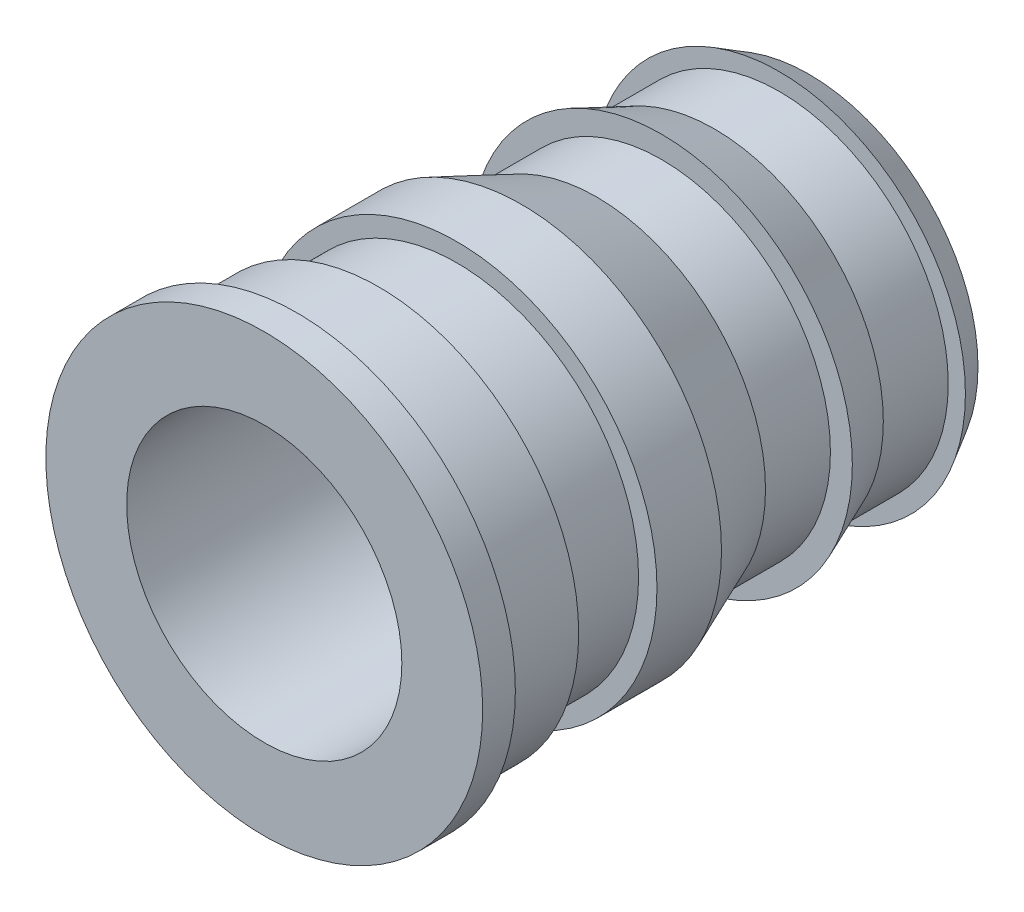
ISO-10303-21;
HEADER;
FILE_DESCRIPTION(('STEP AP214'),'2;1');
FILE_NAME('part.step','',(''),(''),'','','');
FILE_SCHEMA(('AUTOMOTIVE_DESIGN { 1 0 10303 214 1 1 1 1 }'));
ENDSEC;
DATA;
#1=APPLICATION_CONTEXT('core data for automotive mechanical design processes');
#2=APPLICATION_PROTOCOL_DEFINITION('international standard','automotive_design',2000,#1);
#3=PRODUCT_CONTEXT('',#1,'mechanical');
#4=PRODUCT('Part','Part','',(#3));
#5=PRODUCT_RELATED_PRODUCT_CATEGORY('part','',(#4));
#6=PRODUCT_DEFINITION_FORMATION('','',#4);
#7=PRODUCT_DEFINITION_CONTEXT('part definition',#1,'design');
#8=PRODUCT_DEFINITION('design','',#6,#7);
#9=PRODUCT_DEFINITION_SHAPE('','',#8);
#10=(LENGTH_UNIT() NAMED_UNIT(*) SI_UNIT(.MILLI.,.METRE.));
#11=(NAMED_UNIT(*) PLANE_ANGLE_UNIT() SI_UNIT($,.RADIAN.));
#12=(NAMED_UNIT(*) SI_UNIT($,.STERADIAN.) SOLID_ANGLE_UNIT());
#13=UNCERTAINTY_MEASURE_WITH_UNIT(LENGTH_MEASURE(1.E-05),#10,'distance_accuracy_value','');
#14=(GEOMETRIC_REPRESENTATION_CONTEXT(3) GLOBAL_UNCERTAINTY_ASSIGNED_CONTEXT((#13)) GLOBAL_UNIT_ASSIGNED_CONTEXT((#10,
#11,#12)) REPRESENTATION_CONTEXT('',''));
#15=CARTESIAN_POINT('',(0.,0.,0.));
#16=DIRECTION('',(0.,0.,1.));
#17=DIRECTION('',(1.,0.,0.));
#18=AXIS2_PLACEMENT_3D('',#15,#16,#17);
#19=CARTESIAN_POINT('',(0.,0.,3.96));
#20=DIRECTION('',(0.,0.,1.));
#21=DIRECTION('',(1.,0.,0.));
#22=AXIS2_PLACEMENT_3D('',#19,#20,#21);
#23=CYLINDRICAL_SURFACE('',#22,2.);
#24=CARTESIAN_POINT('',(0.,0.,-3.96));
#25=DIRECTION('',(0.,0.,1.));
#26=DIRECTION('',(1.,0.,0.));
#27=AXIS2_PLACEMENT_3D('',#24,#25,#26);
#28=CIRCLE('',#27,2.);
#29=CARTESIAN_POINT('',(2.,0.,-3.96));
#30=VERTEX_POINT('',#29);
#31=EDGE_CURVE('E92',#30,#30,#28,.T.);
#32=ORIENTED_EDGE('',*,*,#31,.F.);
#33=EDGE_LOOP('',(#32));
#34=FACE_BOUND('',#33,.T.);
#35=CARTESIAN_POINT('',(0.,0.,3.96));
#36=DIRECTION('',(0.,0.,1.));
#37=DIRECTION('',(1.,0.,0.));
#38=AXIS2_PLACEMENT_3D('',#35,#36,#37);
#39=CIRCLE('',#38,2.);
#40=CARTESIAN_POINT('',(2.,0.,3.96));
#41=VERTEX_POINT('',#40);
#42=EDGE_CURVE('E10',#41,#41,#39,.T.);
#43=ORIENTED_EDGE('',*,*,#42,.T.);
#44=EDGE_LOOP('',(#43));
#45=FACE_BOUND('',#44,.T.);
#46=ADVANCED_FACE('F37',(#34,#45),#23,.F.);
#47=CARTESIAN_POINT('',(0.,2.,3.96));
#48=DIRECTION('',(0.,0.,-1.));
#49=DIRECTION('',(-1.,0.,0.));
#50=AXIS2_PLACEMENT_3D('',#47,#48,#49);
#51=PLANE('',#50);
#52=ORIENTED_EDGE('',*,*,#42,.F.);
#53=EDGE_LOOP('',(#52));
#54=FACE_BOUND('',#53,.T.);
#55=CARTESIAN_POINT('',(0.,0.,3.96));
#56=DIRECTION('',(0.,0.,1.));
#57=DIRECTION('',(1.,0.,0.));
#58=AXIS2_PLACEMENT_3D('',#55,#56,#57);
#59=CIRCLE('',#58,3.175);
#60=CARTESIAN_POINT('',(3.175,0.,3.96));
#61=VERTEX_POINT('',#60);
#62=EDGE_CURVE('E43',#61,#61,#59,.T.);
#63=ORIENTED_EDGE('',*,*,#62,.T.);
#64=EDGE_LOOP('',(#63));
#65=FACE_BOUND('',#64,.T.);
#66=ADVANCED_FACE('F99',(#54,#65),#51,.F.);
#67=CARTESIAN_POINT('',(0.,0.,3.96));
#68=DIRECTION('',(0.,0.,1.));
#69=DIRECTION('',(1.,0.,0.));
#70=AXIS2_PLACEMENT_3D('',#67,#68,#69);
#71=CYLINDRICAL_SURFACE('',#70,3.175);
#72=ORIENTED_EDGE('',*,*,#62,.F.);
#73=EDGE_LOOP('',(#72));
#74=FACE_BOUND('',#73,.T.);
#75=CARTESIAN_POINT('',(0.,0.,3.4848));
#76=DIRECTION('',(0.,0.,1.));
#77=DIRECTION('',(1.,0.,0.));
#78=AXIS2_PLACEMENT_3D('',#75,#76,#77);
#79=CIRCLE('',#78,3.175);
#80=CARTESIAN_POINT('',(3.175,0.,3.4848));
#81=VERTEX_POINT('',#80);
#82=EDGE_CURVE('E47',#81,#81,#79,.T.);
#83=ORIENTED_EDGE('',*,*,#82,.T.);
#84=EDGE_LOOP('',(#83));
#85=FACE_BOUND('',#84,.T.);
#86=ADVANCED_FACE('F103',(#74,#85),#71,.T.);
#87=CARTESIAN_POINT('',(0.,3.175,3.4848));
#88=DIRECTION('',(0.,0.,1.));
#89=DIRECTION('',(1.,0.,0.));
#90=AXIS2_PLACEMENT_3D('',#87,#88,#89);
#91=PLANE('',#90);
#92=ORIENTED_EDGE('',*,*,#82,.F.);
#93=EDGE_LOOP('',(#92));
#94=FACE_BOUND('',#93,.T.);
#95=CARTESIAN_POINT('',(0.,0.,3.4848));
#96=DIRECTION('',(0.,0.,1.));
#97=DIRECTION('',(1.,0.,0.));
#98=AXIS2_PLACEMENT_3D('',#95,#96,#97);
#99=CIRCLE('',#98,2.9075);
#100=CARTESIAN_POINT('',(2.9075,0.,3.4848));
#101=VERTEX_POINT('',#100);
#102=EDGE_CURVE('E51',#101,#101,#99,.T.);
#103=ORIENTED_EDGE('',*,*,#102,.T.);
#104=EDGE_LOOP('',(#103));
#105=FACE_BOUND('',#104,.T.);
#106=ADVANCED_FACE('F108',(#94,#105),#91,.F.);
#107=CARTESIAN_POINT('',(0.,0.,3.96));
#108=DIRECTION('',(0.,0.,1.));
#109=DIRECTION('',(1.,0.,0.));
#110=AXIS2_PLACEMENT_3D('',#107,#108,#109);
#111=CYLINDRICAL_SURFACE('',#110,2.9075);
#112=ORIENTED_EDGE('',*,*,#102,.F.);
#113=EDGE_LOOP('',(#112));
#114=FACE_BOUND('',#113,.T.);
#115=CARTESIAN_POINT('',(0.,0.,2.2968));
#116=DIRECTION('',(0.,0.,1.));
#117=DIRECTION('',(1.,0.,0.));
#118=AXIS2_PLACEMENT_3D('',#115,#116,#117);
#119=CIRCLE('',#118,2.9075);
#120=CARTESIAN_POINT('',(2.9075,0.,2.2968));
#121=VERTEX_POINT('',#120);
#122=EDGE_CURVE('E56',#121,#121,#119,.T.);
#123=ORIENTED_EDGE('',*,*,#122,.T.);
#124=EDGE_LOOP('',(#123));
#125=FACE_BOUND('',#124,.T.);
#126=ADVANCED_FACE('F114',(#114,#125),#111,.T.);
#127=CARTESIAN_POINT('',(0.,2.9075,2.2968));
#128=DIRECTION('',(0.,0.,1.));
#129=DIRECTION('',(1.,0.,0.));
#130=AXIS2_PLACEMENT_3D('',#127,#128,#129);
#131=PLANE('',#130);
#132=ORIENTED_EDGE('',*,*,#122,.F.);
#133=EDGE_LOOP('',(#132));
#134=FACE_BOUND('',#133,.T.);
#135=CARTESIAN_POINT('',(0.,0.,2.2968));
#136=DIRECTION('',(0.,0.,1.));
#137=DIRECTION('',(1.,0.,0.));
#138=AXIS2_PLACEMENT_3D('',#135,#136,#137);
#139=CIRCLE('',#138,2.64);
#140=CARTESIAN_POINT('',(2.64,0.,2.2968));
#141=VERTEX_POINT('',#140);
#142=EDGE_CURVE('E59',#141,#141,#139,.T.);
#143=ORIENTED_EDGE('',*,*,#142,.T.);
#144=EDGE_LOOP('',(#143));
#145=FACE_BOUND('',#144,.T.);
#146=ADVANCED_FACE('F118',(#134,#145),#131,.F.);
#147=CARTESIAN_POINT('',(0.,0.,3.96));
#148=DIRECTION('',(0.,0.,1.));
#149=DIRECTION('',(1.,0.,0.));
#150=AXIS2_PLACEMENT_3D('',#147,#148,#149);
#151=CYLINDRICAL_SURFACE('',#150,2.64);
#152=ORIENTED_EDGE('',*,*,#142,.F.);
#153=EDGE_LOOP('',(#152));
#154=FACE_BOUND('',#153,.T.);
#155=CARTESIAN_POINT('',(0.,0.,1.15894666632655));
#156=DIRECTION('',(0.,0.,1.));
#157=DIRECTION('',(1.,0.,0.));
#158=AXIS2_PLACEMENT_3D('',#155,#156,#157);
#159=CIRCLE('',#158,2.64);
#160=CARTESIAN_POINT('',(2.64,0.,1.15894666632655));
#161=VERTEX_POINT('',#160);
#162=EDGE_CURVE('E62',#161,#161,#159,.T.);
#163=ORIENTED_EDGE('',*,*,#162,.T.);
#164=EDGE_LOOP('',(#163));
#165=FACE_BOUND('',#164,.T.);
#166=ADVANCED_FACE('F122',(#154,#165),#151,.T.);
#167=CARTESIAN_POINT('',(0.,2.64,1.15894666632655));
#168=DIRECTION('',(0.,0.,-1.));
#169=DIRECTION('',(-1.,0.,0.));
#170=AXIS2_PLACEMENT_3D('',#167,#168,#169);
#171=PLANE('',#170);
#172=ORIENTED_EDGE('',*,*,#162,.F.);
#173=EDGE_LOOP('',(#172));
#174=FACE_BOUND('',#173,.T.);
#175=CARTESIAN_POINT('',(0.,0.,1.15894666632655));
#176=DIRECTION('',(0.,0.,1.));
#177=DIRECTION('',(1.,0.,0.));
#178=AXIS2_PLACEMENT_3D('',#175,#176,#177);
#179=CIRCLE('',#178,2.9075);
#180=CARTESIAN_POINT('',(2.9075,0.,1.15894666632655));
#181=VERTEX_POINT('',#180);
#182=EDGE_CURVE('E65',#181,#181,#179,.T.);
#183=ORIENTED_EDGE('',*,*,#182,.T.);
#184=EDGE_LOOP('',(#183));
#185=FACE_BOUND('',#184,.T.);
#186=ADVANCED_FACE('F126',(#174,#185),#171,.F.);
#187=CARTESIAN_POINT('',(0.,0.,3.96));
#188=DIRECTION('',(0.,0.,1.));
#189=DIRECTION('',(1.,0.,0.));
#190=AXIS2_PLACEMENT_3D('',#187,#188,#189);
#191=CYLINDRICAL_SURFACE('',#190,2.9075);
#192=ORIENTED_EDGE('',*,*,#182,.F.);
#193=EDGE_LOOP('',(#192));
#194=FACE_BOUND('',#193,.T.);
#195=CARTESIAN_POINT('',(0.,0.,0.220748794261348));
#196=DIRECTION('',(0.,0.,1.));
#197=DIRECTION('',(1.,0.,0.));
#198=AXIS2_PLACEMENT_3D('',#195,#196,#197);
#199=CIRCLE('',#198,2.9075);
#200=CARTESIAN_POINT('',(2.9075,0.,0.220748794261348));
#201=VERTEX_POINT('',#200);
#202=EDGE_CURVE('E68',#201,#201,#199,.T.);
#203=ORIENTED_EDGE('',*,*,#202,.T.);
#204=EDGE_LOOP('',(#203));
#205=FACE_BOUND('',#204,.T.);
#206=ADVANCED_FACE('F130',(#194,#205),#191,.T.);
#207=CARTESIAN_POINT('',(0.,0.,-0.8712));
#208=DIRECTION('',(0.,0.,1.));
#209=DIRECTION('',(1.,0.,0.));
#210=AXIS2_PLACEMENT_3D('',#207,#208,#209);
#211=CONICAL_SURFACE('',#210,2.4552,0.392699081698725);
#212=ORIENTED_EDGE('',*,*,#202,.F.);
#213=EDGE_LOOP('',(#212));
#214=FACE_BOUND('',#213,.T.);
#215=CARTESIAN_POINT('',(0.,0.,-0.8712));
#216=DIRECTION('',(0.,0.,1.));
#217=DIRECTION('',(1.,0.,0.));
#218=AXIS2_PLACEMENT_3D('',#215,#216,#217);
#219=CIRCLE('',#218,2.4552);
#220=CARTESIAN_POINT('',(2.4552,0.,-0.8712));
#221=VERTEX_POINT('',#220);
#222=EDGE_CURVE('E71',#221,#221,#219,.T.);
#223=ORIENTED_EDGE('',*,*,#222,.T.);
#224=EDGE_LOOP('',(#223));
#225=FACE_BOUND('',#224,.T.);
#226=ADVANCED_FACE('F134',(#214,#225),#211,.T.);
#227=CARTESIAN_POINT('',(0.,0.,3.96));
#228=DIRECTION('',(0.,0.,1.));
#229=DIRECTION('',(1.,0.,0.));
#230=AXIS2_PLACEMENT_3D('',#227,#228,#229);
#231=CYLINDRICAL_SURFACE('',#230,2.4552);
#232=ORIENTED_EDGE('',*,*,#222,.F.);
#233=EDGE_LOOP('',(#232));
#234=FACE_BOUND('',#233,.T.);
#235=CARTESIAN_POINT('',(0.,0.,-1.81474298898767));
#236=DIRECTION('',(0.,0.,1.));
#237=DIRECTION('',(1.,0.,0.));
#238=AXIS2_PLACEMENT_3D('',#235,#236,#237);
#239=CIRCLE('',#238,2.4552);
#240=CARTESIAN_POINT('',(2.4552,0.,-1.81474298898767));
#241=VERTEX_POINT('',#240);
#242=EDGE_CURVE('E74',#241,#241,#239,.T.);
#243=ORIENTED_EDGE('',*,*,#242,.T.);
#244=EDGE_LOOP('',(#243));
#245=FACE_BOUND('',#244,.T.);
#246=ADVANCED_FACE('F138',(#234,#245),#231,.T.);
#247=CARTESIAN_POINT('',(0.,2.77375,-1.81474298898767));
#248=DIRECTION('',(0.,0.,-1.));
#249=DIRECTION('',(-1.,0.,0.));
#250=AXIS2_PLACEMENT_3D('',#247,#248,#249);
#251=PLANE('',#250);
#252=ORIENTED_EDGE('',*,*,#242,.F.);
#253=EDGE_LOOP('',(#252));
#254=FACE_BOUND('',#253,.T.);
#255=CARTESIAN_POINT('',(0.,0.,-1.81474298898767));
#256=DIRECTION('',(0.,0.,1.));
#257=DIRECTION('',(1.,0.,0.));
#258=AXIS2_PLACEMENT_3D('',#255,#256,#257);
#259=CIRCLE('',#258,2.77375);
#260=CARTESIAN_POINT('',(2.77375,0.,-1.81474298898767));
#261=VERTEX_POINT('',#260);
#262=EDGE_CURVE('E77',#261,#261,#259,.T.);
#263=ORIENTED_EDGE('',*,*,#262,.T.);
#264=EDGE_LOOP('',(#263));
#265=FACE_BOUND('',#264,.T.);
#266=ADVANCED_FACE('F142',(#254,#265),#251,.F.);
#267=CARTESIAN_POINT('',(0.,0.,-2.58379071928162));
#268=DIRECTION('',(0.,0.,1.));
#269=DIRECTION('',(1.,0.,0.));
#270=AXIS2_PLACEMENT_3D('',#267,#268,#269);
#271=CONICAL_SURFACE('',#270,2.4552,0.392699081698724);
#272=ORIENTED_EDGE('',*,*,#262,.F.);
#273=EDGE_LOOP('',(#272));
#274=FACE_BOUND('',#273,.T.);
#275=CARTESIAN_POINT('',(0.,0.,-2.58379071928162));
#276=DIRECTION('',(0.,0.,1.));
#277=DIRECTION('',(1.,0.,0.));
#278=AXIS2_PLACEMENT_3D('',#275,#276,#277);
#279=CIRCLE('',#278,2.4552);
#280=CARTESIAN_POINT('',(2.4552,0.,-2.58379071928162));
#281=VERTEX_POINT('',#280);
#282=EDGE_CURVE('E80',#281,#281,#279,.T.);
#283=ORIENTED_EDGE('',*,*,#282,.T.);
#284=EDGE_LOOP('',(#283));
#285=FACE_BOUND('',#284,.T.);
#286=ADVANCED_FACE('F146',(#274,#285),#271,.T.);
#287=CARTESIAN_POINT('',(0.,0.,3.96));
#288=DIRECTION('',(0.,0.,1.));
#289=DIRECTION('',(1.,0.,0.));
#290=AXIS2_PLACEMENT_3D('',#287,#288,#289);
#291=CYLINDRICAL_SURFACE('',#290,2.4552);
#292=ORIENTED_EDGE('',*,*,#282,.F.);
#293=EDGE_LOOP('',(#292));
#294=FACE_BOUND('',#293,.T.);
#295=CARTESIAN_POINT('',(0.,0.,-3.5273337082693));
#296=DIRECTION('',(0.,0.,1.));
#297=DIRECTION('',(1.,0.,0.));
#298=AXIS2_PLACEMENT_3D('',#295,#296,#297);
#299=CIRCLE('',#298,2.4552);
#300=CARTESIAN_POINT('',(2.4552,0.,-3.5273337082693));
#301=VERTEX_POINT('',#300);
#302=EDGE_CURVE('E83',#301,#301,#299,.T.);
#303=ORIENTED_EDGE('',*,*,#302,.T.);
#304=EDGE_LOOP('',(#303));
#305=FACE_BOUND('',#304,.T.);
#306=ADVANCED_FACE('F150',(#294,#305),#291,.T.);
#307=CARTESIAN_POINT('',(0.,2.4552,-3.5273337082693));
#308=DIRECTION('',(0.,0.,-1.));
#309=DIRECTION('',(-1.,0.,0.));
#310=AXIS2_PLACEMENT_3D('',#307,#308,#309);
#311=PLANE('',#310);
#312=ORIENTED_EDGE('',*,*,#302,.F.);
#313=EDGE_LOOP('',(#312));
#314=FACE_BOUND('',#313,.T.);
#315=CARTESIAN_POINT('',(0.,0.,-3.5273337082693));
#316=DIRECTION('',(0.,0.,1.));
#317=DIRECTION('',(1.,0.,0.));
#318=AXIS2_PLACEMENT_3D('',#315,#316,#317);
#319=CIRCLE('',#318,2.705);
#320=CARTESIAN_POINT('',(2.705,0.,-3.5273337082693));
#321=VERTEX_POINT('',#320);
#322=EDGE_CURVE('E86',#321,#321,#319,.T.);
#323=ORIENTED_EDGE('',*,*,#322,.T.);
#324=EDGE_LOOP('',(#323));
#325=FACE_BOUND('',#324,.T.);
#326=ADVANCED_FACE('F154',(#314,#325),#311,.F.);
#327=CARTESIAN_POINT('',(0.,0.,-3.96));
#328=DIRECTION('',(0.,0.,1.));
#329=DIRECTION('',(1.,0.,0.));
#330=AXIS2_PLACEMENT_3D('',#327,#328,#329);
#331=CONICAL_SURFACE('',#330,2.4552,0.5235987755983);
#332=ORIENTED_EDGE('',*,*,#322,.F.);
#333=EDGE_LOOP('',(#332));
#334=FACE_BOUND('',#333,.T.);
#335=CARTESIAN_POINT('',(0.,0.,-3.96));
#336=DIRECTION('',(0.,0.,1.));
#337=DIRECTION('',(1.,0.,0.));
#338=AXIS2_PLACEMENT_3D('',#335,#336,#337);
#339=CIRCLE('',#338,2.4552);
#340=CARTESIAN_POINT('',(2.4552,0.,-3.96));
#341=VERTEX_POINT('',#340);
#342=EDGE_CURVE('E89',#341,#341,#339,.T.);
#343=ORIENTED_EDGE('',*,*,#342,.T.);
#344=EDGE_LOOP('',(#343));
#345=FACE_BOUND('',#344,.T.);
#346=ADVANCED_FACE('F158',(#334,#345),#331,.T.);
#347=CARTESIAN_POINT('',(0.,2.4552,-3.96));
#348=DIRECTION('',(0.,0.,1.));
#349=DIRECTION('',(1.,0.,0.));
#350=AXIS2_PLACEMENT_3D('',#347,#348,#349);
#351=PLANE('',#350);
#352=ORIENTED_EDGE('',*,*,#342,.F.);
#353=EDGE_LOOP('',(#352));
#354=FACE_BOUND('',#353,.T.);
#355=ORIENTED_EDGE('',*,*,#31,.T.);
#356=EDGE_LOOP('',(#355));
#357=FACE_BOUND('',#356,.T.);
#358=ADVANCED_FACE('F96',(#354,#357),#351,.F.);
#359=CLOSED_SHELL('',(#46,#66,#86,#106,#126,#146,#166,#186,#206,#226,#246,#266,#286,#306,#326,
#346,#358));
#360=MANIFOLD_SOLID_BREP('B2',#359);
#361=ADVANCED_BREP_SHAPE_REPRESENTATION('',(#18,#360),#14);
#362=SHAPE_DEFINITION_REPRESENTATION(#9,#361);
ENDSEC;
END-ISO-10303-21;
